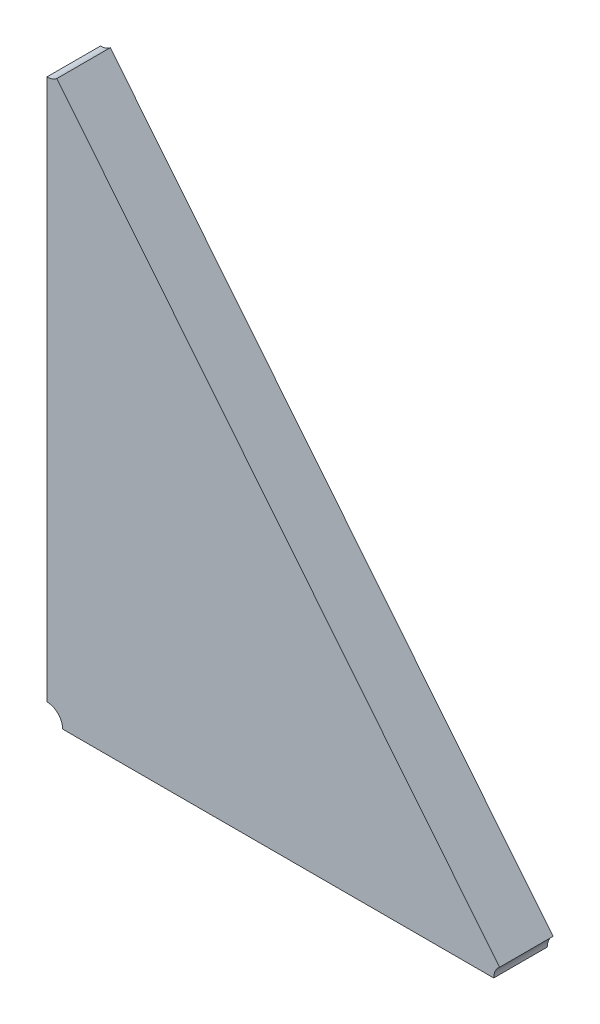
ISO-10303-21;
HEADER;
FILE_DESCRIPTION(('STEP AP214'),'2;1');
FILE_NAME('part.step','',(''),(''),'','','');
FILE_SCHEMA(('AUTOMOTIVE_DESIGN { 1 0 10303 214 1 1 1 1 }'));
ENDSEC;
DATA;
#1=APPLICATION_CONTEXT('core data for automotive mechanical design processes');
#2=APPLICATION_PROTOCOL_DEFINITION('international standard','automotive_design',2000,#1);
#3=PRODUCT_CONTEXT('',#1,'mechanical');
#4=PRODUCT('Part','Part','',(#3));
#5=PRODUCT_RELATED_PRODUCT_CATEGORY('part','',(#4));
#6=PRODUCT_DEFINITION_FORMATION('','',#4);
#7=PRODUCT_DEFINITION_CONTEXT('part definition',#1,'design');
#8=PRODUCT_DEFINITION('design','',#6,#7);
#9=PRODUCT_DEFINITION_SHAPE('','',#8);
#10=(LENGTH_UNIT() NAMED_UNIT(*) SI_UNIT(.MILLI.,.METRE.));
#11=(NAMED_UNIT(*) PLANE_ANGLE_UNIT() SI_UNIT($,.RADIAN.));
#12=(NAMED_UNIT(*) SI_UNIT($,.STERADIAN.) SOLID_ANGLE_UNIT());
#13=UNCERTAINTY_MEASURE_WITH_UNIT(LENGTH_MEASURE(1.E-05),#10,'distance_accuracy_value','');
#14=(GEOMETRIC_REPRESENTATION_CONTEXT(3) GLOBAL_UNCERTAINTY_ASSIGNED_CONTEXT((#13)) GLOBAL_UNIT_ASSIGNED_CONTEXT((#10,
#11,#12)) REPRESENTATION_CONTEXT('',''));
#15=CARTESIAN_POINT('',(0.,0.,0.));
#16=DIRECTION('',(0.,0.,1.));
#17=DIRECTION('',(1.,0.,0.));
#18=AXIS2_PLACEMENT_3D('',#15,#16,#17);
#19=CARTESIAN_POINT('',(-1.56070988502484,-1.35463051118407,0.0042));
#20=DIRECTION('',(0.,0.,1.));
#21=DIRECTION('',(1.,0.,0.));
#22=AXIS2_PLACEMENT_3D('',#19,#20,#21);
#23=PLANE('',#22);
#24=CARTESIAN_POINT('',(-1.58055983163915,-1.38144679395879,0.0042));
#25=DIRECTION('',(0.,0.,-1.));
#26=DIRECTION('',(0.,1.,0.));
#27=AXIS2_PLACEMENT_3D('',#24,#25,#26);
#28=CIRCLE('',#27,0.002);
#29=CARTESIAN_POINT('',(-1.58055983163915,-1.37944679395879,0.0042));
#30=VERTEX_POINT('',#29);
#31=CARTESIAN_POINT('',(-1.57855983163915,-1.38144679395879,0.0042));
#32=VERTEX_POINT('',#31);
#33=EDGE_CURVE('E11',#30,#32,#28,.T.);
#34=ORIENTED_EDGE('',*,*,#33,.T.);
#35=DIRECTION('',(1.,0.,0.));
#36=VECTOR('',#35,1.);
#37=CARTESIAN_POINT('',(-1.57855983163915,-1.38144679395879,0.0042));
#38=LINE('',#37,#36);
#39=CARTESIAN_POINT('',(-1.52375259457001,-1.38144679395879,0.0042));
#40=VERTEX_POINT('',#39);
#41=EDGE_CURVE('E83',#32,#40,#38,.T.);
#42=ORIENTED_EDGE('',*,*,#41,.T.);
#43=CARTESIAN_POINT('',(-1.52175259457001,-1.38144679395879,0.0042));
#44=DIRECTION('',(0.,0.,-1.));
#45=DIRECTION('',(-1.,0.,0.));
#46=AXIS2_PLACEMENT_3D('',#43,#44,#45);
#47=CIRCLE('',#46,0.002);
#48=CARTESIAN_POINT('',(-1.52300917298691,-1.37989083422853,0.0042));
#49=VERTEX_POINT('',#48);
#50=EDGE_CURVE('E107',#40,#49,#47,.T.);
#51=ORIENTED_EDGE('',*,*,#50,.T.);
#52=DIRECTION('',(-0.628289208450207,0.777979865128277,0.));
#53=VECTOR('',#52,1.);
#54=CARTESIAN_POINT('',(-1.52300917298691,-1.37989083422853,0.0042));
#55=LINE('',#54,#53);
#56=CARTESIAN_POINT('',(-1.57930325322225,-1.31018462193015,0.0042));
#57=VERTEX_POINT('',#56);
#58=EDGE_CURVE('E110',#49,#57,#55,.T.);
#59=ORIENTED_EDGE('',*,*,#58,.T.);
#60=CARTESIAN_POINT('',(-1.58055983163915,-1.30862866219989,0.0042));
#61=DIRECTION('',(0.,0.,-1.));
#62=DIRECTION('',(0.628289208449251,-0.77797986512905,0.));
#63=AXIS2_PLACEMENT_3D('',#60,#61,#62);
#64=CIRCLE('',#63,0.00200000000000002);
#65=CARTESIAN_POINT('',(-1.58055983163915,-1.31062866219989,0.0042));
#66=VERTEX_POINT('',#65);
#67=EDGE_CURVE('E74',#57,#66,#64,.T.);
#68=ORIENTED_EDGE('',*,*,#67,.T.);
#69=DIRECTION('',(0.,-1.,0.));
#70=VECTOR('',#69,1.);
#71=CARTESIAN_POINT('',(-1.58055983163915,-1.31062866219989,0.0042));
#72=LINE('',#71,#70);
#73=EDGE_CURVE('E103',#66,#30,#72,.T.);
#74=ORIENTED_EDGE('',*,*,#73,.T.);
#75=EDGE_LOOP('',(#34,#42,#51,#59,#68,#74));
#76=FACE_BOUND('',#75,.T.);
#77=ADVANCED_FACE('F17',(#76),#23,.T.);
#78=CARTESIAN_POINT('',(-1.52175259457001,-1.38144679395879,-0.0026));
#79=DIRECTION('',(0.777979865128275,0.628289208450209,0.));
#80=DIRECTION('',(-0.628289208450209,0.777979865128275,0.));
#81=AXIS2_PLACEMENT_3D('',#78,#79,#80);
#82=PLANE('',#81);
#83=DIRECTION('',(0.,0.,1.));
#84=VECTOR('',#83,1.);
#85=CARTESIAN_POINT('',(-1.57930325322225,-1.31018462193015,-0.0026));
#86=LINE('',#85,#84);
#87=CARTESIAN_POINT('',(-1.57930325322225,-1.31018462193015,-0.0026));
#88=VERTEX_POINT('',#87);
#89=EDGE_CURVE('E24',#88,#57,#86,.T.);
#90=ORIENTED_EDGE('',*,*,#89,.T.);
#91=ORIENTED_EDGE('',*,*,#58,.F.);
#92=DIRECTION('',(0.,0.,-1.));
#93=VECTOR('',#92,1.);
#94=CARTESIAN_POINT('',(-1.52300917298691,-1.37989083422853,0.0042));
#95=LINE('',#94,#93);
#96=CARTESIAN_POINT('',(-1.52300917298691,-1.37989083422853,-0.0026));
#97=VERTEX_POINT('',#96);
#98=EDGE_CURVE('E68',#49,#97,#95,.T.);
#99=ORIENTED_EDGE('',*,*,#98,.T.);
#100=DIRECTION('',(-0.628289208450206,0.777979865128278,0.));
#101=VECTOR('',#100,1.);
#102=CARTESIAN_POINT('',(-1.52300917298691,-1.37989083422853,-0.0026));
#103=LINE('',#102,#101);
#104=EDGE_CURVE('E65',#97,#88,#103,.T.);
#105=ORIENTED_EDGE('',*,*,#104,.T.);
#106=EDGE_LOOP('',(#90,#91,#99,#105));
#107=FACE_BOUND('',#106,.T.);
#108=ADVANCED_FACE('F66',(#107),#82,.T.);
#109=CARTESIAN_POINT('',(-1.58055983163915,-1.30862866219989,-0.0026));
#110=DIRECTION('',(-1.,0.,0.));
#111=DIRECTION('',(0.,-1.,0.));
#112=AXIS2_PLACEMENT_3D('',#109,#110,#111);
#113=PLANE('',#112);
#114=DIRECTION('',(0.,0.,1.));
#115=VECTOR('',#114,1.);
#116=CARTESIAN_POINT('',(-1.58055983163915,-1.37944679395879,-0.0026));
#117=LINE('',#116,#115);
#118=CARTESIAN_POINT('',(-1.58055983163915,-1.37944679395879,-0.0026));
#119=VERTEX_POINT('',#118);
#120=EDGE_CURVE('E112',#119,#30,#117,.T.);
#121=ORIENTED_EDGE('',*,*,#120,.T.);
#122=ORIENTED_EDGE('',*,*,#73,.F.);
#123=DIRECTION('',(0.,0.,-1.));
#124=VECTOR('',#123,1.);
#125=CARTESIAN_POINT('',(-1.58055983163915,-1.31062866219989,0.0042));
#126=LINE('',#125,#124);
#127=CARTESIAN_POINT('',(-1.58055983163915,-1.31062866219989,-0.0026));
#128=VERTEX_POINT('',#127);
#129=EDGE_CURVE('E73',#66,#128,#126,.T.);
#130=ORIENTED_EDGE('',*,*,#129,.T.);
#131=DIRECTION('',(0.,-1.,0.));
#132=VECTOR('',#131,1.);
#133=CARTESIAN_POINT('',(-1.58055983163915,-1.31062866219989,-0.0026));
#134=LINE('',#133,#132);
#135=EDGE_CURVE('E87',#128,#119,#134,.T.);
#136=ORIENTED_EDGE('',*,*,#135,.T.);
#137=EDGE_LOOP('',(#121,#122,#130,#136));
#138=FACE_BOUND('',#137,.T.);
#139=ADVANCED_FACE('F126',(#138),#113,.T.);
#140=CARTESIAN_POINT('',(-1.58055983163915,-1.38144679395879,-0.0026));
#141=DIRECTION('',(0.,-1.,0.));
#142=DIRECTION('',(1.,0.,0.));
#143=AXIS2_PLACEMENT_3D('',#140,#141,#142);
#144=PLANE('',#143);
#145=DIRECTION('',(0.,0.,-1.));
#146=VECTOR('',#145,1.);
#147=CARTESIAN_POINT('',(-1.57855983163915,-1.38144679395879,0.0042));
#148=LINE('',#147,#146);
#149=CARTESIAN_POINT('',(-1.57855983163915,-1.38144679395879,-0.0026));
#150=VERTEX_POINT('',#149);
#151=EDGE_CURVE('E105',#32,#150,#148,.T.);
#152=ORIENTED_EDGE('',*,*,#151,.T.);
#153=DIRECTION('',(1.,0.,0.));
#154=VECTOR('',#153,1.);
#155=CARTESIAN_POINT('',(-1.57855983163915,-1.38144679395879,-0.0026));
#156=LINE('',#155,#154);
#157=CARTESIAN_POINT('',(-1.52375259457001,-1.38144679395879,-0.0026));
#158=VERTEX_POINT('',#157);
#159=EDGE_CURVE('E98',#150,#158,#156,.T.);
#160=ORIENTED_EDGE('',*,*,#159,.T.);
#161=DIRECTION('',(0.,0.,1.));
#162=VECTOR('',#161,1.);
#163=CARTESIAN_POINT('',(-1.52375259457001,-1.38144679395879,-0.0026));
#164=LINE('',#163,#162);
#165=EDGE_CURVE('E88',#158,#40,#164,.T.);
#166=ORIENTED_EDGE('',*,*,#165,.T.);
#167=ORIENTED_EDGE('',*,*,#41,.F.);
#168=EDGE_LOOP('',(#152,#160,#166,#167));
#169=FACE_BOUND('',#168,.T.);
#170=ADVANCED_FACE('F118',(#169),#144,.T.);
#171=CARTESIAN_POINT('',(-1.56066280712309,-1.35454432209785,-0.0026));
#172=DIRECTION('',(0.,0.,1.));
#173=DIRECTION('',(1.,0.,0.));
#174=AXIS2_PLACEMENT_3D('',#171,#172,#173);
#175=PLANE('',#174);
#176=CARTESIAN_POINT('',(-1.58055983163915,-1.38144679395879,-0.0026));
#177=DIRECTION('',(0.,0.,1.));
#178=DIRECTION('',(1.,0.,0.));
#179=AXIS2_PLACEMENT_3D('',#176,#177,#178);
#180=CIRCLE('',#179,0.002);
#181=EDGE_CURVE('E100',#150,#119,#180,.T.);
#182=ORIENTED_EDGE('',*,*,#181,.T.);
#183=ORIENTED_EDGE('',*,*,#135,.F.);
#184=CARTESIAN_POINT('',(-1.58055983163915,-1.30862866219989,-0.0026));
#185=DIRECTION('',(0.,0.,1.));
#186=DIRECTION('',(0.,-1.,0.));
#187=AXIS2_PLACEMENT_3D('',#184,#185,#186);
#188=CIRCLE('',#187,0.00200000000000002);
#189=EDGE_CURVE('E81',#128,#88,#188,.T.);
#190=ORIENTED_EDGE('',*,*,#189,.T.);
#191=ORIENTED_EDGE('',*,*,#104,.F.);
#192=CARTESIAN_POINT('',(-1.52175259457001,-1.38144679395879,-0.0026));
#193=DIRECTION('',(0.,0.,1.));
#194=DIRECTION('',(-0.628289208449251,0.77797986512905,0.));
#195=AXIS2_PLACEMENT_3D('',#192,#193,#194);
#196=CIRCLE('',#195,0.002);
#197=EDGE_CURVE('E89',#97,#158,#196,.T.);
#198=ORIENTED_EDGE('',*,*,#197,.T.);
#199=ORIENTED_EDGE('',*,*,#159,.F.);
#200=EDGE_LOOP('',(#182,#183,#190,#191,#198,#199));
#201=FACE_BOUND('',#200,.T.);
#202=ADVANCED_FACE('F85',(#201),#175,.F.);
#203=CARTESIAN_POINT('',(-1.52175259457001,-1.38144679395879,-0.0018));
#204=DIRECTION('',(0.,0.,1.));
#205=DIRECTION('',(-1.,0.,0.));
#206=AXIS2_PLACEMENT_3D('',#203,#204,#205);
#207=CYLINDRICAL_SURFACE('',#206,0.002);
#208=ORIENTED_EDGE('',*,*,#98,.F.);
#209=ORIENTED_EDGE('',*,*,#50,.F.);
#210=ORIENTED_EDGE('',*,*,#165,.F.);
#211=ORIENTED_EDGE('',*,*,#197,.F.);
#212=EDGE_LOOP('',(#208,#209,#210,#211));
#213=FACE_BOUND('',#212,.T.);
#214=ADVANCED_FACE('F121',(#213),#207,.F.);
#215=CARTESIAN_POINT('',(-1.58055983163915,-1.30862866219989,-0.0018));
#216=DIRECTION('',(0.,0.,1.));
#217=DIRECTION('',(-1.,0.,0.));
#218=AXIS2_PLACEMENT_3D('',#215,#216,#217);
#219=CYLINDRICAL_SURFACE('',#218,0.00200000000000002);
#220=ORIENTED_EDGE('',*,*,#89,.F.);
#221=ORIENTED_EDGE('',*,*,#189,.F.);
#222=ORIENTED_EDGE('',*,*,#129,.F.);
#223=ORIENTED_EDGE('',*,*,#67,.F.);
#224=EDGE_LOOP('',(#220,#221,#222,#223));
#225=FACE_BOUND('',#224,.T.);
#226=ADVANCED_FACE('F79',(#225),#219,.F.);
#227=CARTESIAN_POINT('',(-1.58055983163915,-1.38144679395879,-0.0018));
#228=DIRECTION('',(0.,0.,1.));
#229=DIRECTION('',(-1.,0.,0.));
#230=AXIS2_PLACEMENT_3D('',#227,#228,#229);
#231=CYLINDRICAL_SURFACE('',#230,0.002);
#232=ORIENTED_EDGE('',*,*,#120,.F.);
#233=ORIENTED_EDGE('',*,*,#181,.F.);
#234=ORIENTED_EDGE('',*,*,#151,.F.);
#235=ORIENTED_EDGE('',*,*,#33,.F.);
#236=EDGE_LOOP('',(#232,#233,#234,#235));
#237=FACE_BOUND('',#236,.T.);
#238=ADVANCED_FACE('F127',(#237),#231,.F.);
#239=CLOSED_SHELL('',(#77,#108,#139,#170,#202,#214,#226,#238));
#240=MANIFOLD_SOLID_BREP('B1',#239);
#241=ADVANCED_BREP_SHAPE_REPRESENTATION('',(#18,#240),#14);
#242=SHAPE_DEFINITION_REPRESENTATION(#9,#241);
ENDSEC;
END-ISO-10303-21;
